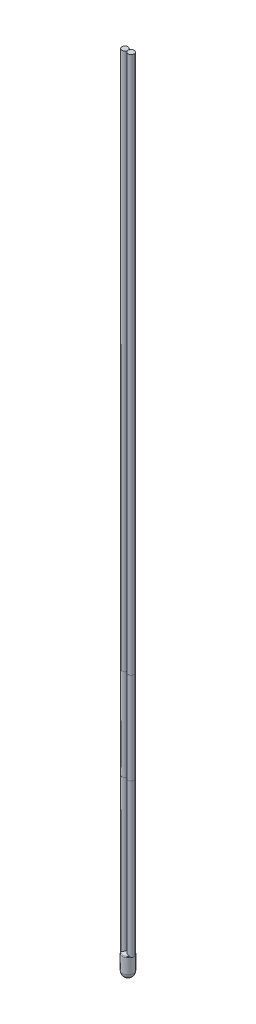
ISO-10303-21;
HEADER;
FILE_DESCRIPTION(('STEP AP214'),'2;1');
FILE_NAME('part.step','',(''),(''),'','','');
FILE_SCHEMA(('AUTOMOTIVE_DESIGN { 1 0 10303 214 1 1 1 1 }'));
ENDSEC;
DATA;
#1=APPLICATION_CONTEXT('core data for automotive mechanical design processes');
#2=APPLICATION_PROTOCOL_DEFINITION('international standard','automotive_design',2000,#1);
#3=PRODUCT_CONTEXT('',#1,'mechanical');
#4=PRODUCT('Part','Part','',(#3));
#5=PRODUCT_RELATED_PRODUCT_CATEGORY('part','',(#4));
#6=PRODUCT_DEFINITION_FORMATION('','',#4);
#7=PRODUCT_DEFINITION_CONTEXT('part definition',#1,'design');
#8=PRODUCT_DEFINITION('design','',#6,#7);
#9=PRODUCT_DEFINITION_SHAPE('','',#8);
#10=(LENGTH_UNIT() NAMED_UNIT(*) SI_UNIT(.MILLI.,.METRE.));
#11=(NAMED_UNIT(*) PLANE_ANGLE_UNIT() SI_UNIT($,.RADIAN.));
#12=(NAMED_UNIT(*) SI_UNIT($,.STERADIAN.) SOLID_ANGLE_UNIT());
#13=UNCERTAINTY_MEASURE_WITH_UNIT(LENGTH_MEASURE(1.E-05),#10,'distance_accuracy_value','');
#14=(GEOMETRIC_REPRESENTATION_CONTEXT(3) GLOBAL_UNCERTAINTY_ASSIGNED_CONTEXT((#13)) GLOBAL_UNIT_ASSIGNED_CONTEXT((#10,
#11,#12)) REPRESENTATION_CONTEXT('',''));
#15=CARTESIAN_POINT('',(0.,0.,0.));
#16=DIRECTION('',(0.,0.,1.));
#17=DIRECTION('',(1.,0.,0.));
#18=AXIS2_PLACEMENT_3D('',#15,#16,#17);
#19=CARTESIAN_POINT('',(0.4,130.41515621348,0.));
#20=DIRECTION('',(0.,-1.,0.));
#21=DIRECTION('',(0.,0.,-1.));
#22=AXIS2_PLACEMENT_3D('',#19,#20,#21);
#23=CYLINDRICAL_SURFACE('',#22,0.5);
#24=CARTESIAN_POINT('',(0.4,130.41515621348,0.));
#25=DIRECTION('',(0.,-1.,0.));
#26=DIRECTION('',(0.,0.,-1.));
#27=AXIS2_PLACEMENT_3D('',#24,#25,#26);
#28=CIRCLE('',#27,0.5);
#29=CARTESIAN_POINT('',(0.4,130.41515621348,-0.5));
#30=VERTEX_POINT('',#29);
#31=EDGE_CURVE('E11',#30,#30,#28,.T.);
#32=ORIENTED_EDGE('',*,*,#31,.T.);
#33=EDGE_LOOP('',(#32));
#34=FACE_BOUND('',#33,.T.);
#35=CARTESIAN_POINT('',(0.4,42.4151562134801,0.));
#36=DIRECTION('',(0.,-1.,0.));
#37=DIRECTION('',(0.,0.,-1.));
#38=AXIS2_PLACEMENT_3D('',#35,#36,#37);
#39=CIRCLE('',#38,0.5);
#40=CARTESIAN_POINT('',(0.4,42.4151562134801,-0.5));
#41=VERTEX_POINT('',#40);
#42=EDGE_CURVE('E44',#41,#41,#39,.T.);
#43=ORIENTED_EDGE('',*,*,#42,.F.);
#44=EDGE_LOOP('',(#43));
#45=FACE_BOUND('',#44,.T.);
#46=ADVANCED_FACE('F41',(#34,#45),#23,.T.);
#47=CARTESIAN_POINT('',(0.4,130.41515621348,0.));
#48=DIRECTION('',(0.,-1.,0.));
#49=DIRECTION('',(0.,0.,-1.));
#50=AXIS2_PLACEMENT_3D('',#47,#48,#49);
#51=PLANE('',#50);
#52=ORIENTED_EDGE('',*,*,#31,.F.);
#53=EDGE_LOOP('',(#52));
#54=FACE_BOUND('',#53,.T.);
#55=ADVANCED_FACE('F56',(#54),#51,.F.);
#56=CARTESIAN_POINT('',(0.4,42.4151562134801,0.));
#57=DIRECTION('',(0.,-1.,0.));
#58=DIRECTION('',(0.,0.,-1.));
#59=AXIS2_PLACEMENT_3D('',#56,#57,#58);
#60=PLANE('',#59);
#61=ORIENTED_EDGE('',*,*,#42,.T.);
#62=EDGE_LOOP('',(#61));
#63=FACE_BOUND('',#62,.T.);
#64=ADVANCED_FACE('F53',(#63),#60,.T.);
#65=CLOSED_SHELL('',(#46,#55,#64));
#66=MANIFOLD_SOLID_BREP('B2',#65);
#67=CARTESIAN_POINT('',(1.41,130.41515621348,0.));
#68=DIRECTION('',(0.,-1.,0.));
#69=DIRECTION('',(0.,0.,-1.));
#70=AXIS2_PLACEMENT_3D('',#67,#68,#69);
#71=CYLINDRICAL_SURFACE('',#70,0.5);
#72=CARTESIAN_POINT('',(1.41,130.41515621348,0.));
#73=DIRECTION('',(0.,-1.,0.));
#74=DIRECTION('',(0.,0.,-1.));
#75=AXIS2_PLACEMENT_3D('',#72,#73,#74);
#76=CIRCLE('',#75,0.5);
#77=CARTESIAN_POINT('',(1.41,130.41515621348,-0.5));
#78=VERTEX_POINT('',#77);
#79=EDGE_CURVE('E40',#78,#78,#76,.T.);
#80=ORIENTED_EDGE('',*,*,#79,.T.);
#81=EDGE_LOOP('',(#80));
#82=FACE_BOUND('',#81,.T.);
#83=CARTESIAN_POINT('',(1.41,42.4151562134801,0.));
#84=DIRECTION('',(0.,-1.,0.));
#85=DIRECTION('',(0.,0.,-1.));
#86=AXIS2_PLACEMENT_3D('',#83,#84,#85);
#87=CIRCLE('',#86,0.5);
#88=CARTESIAN_POINT('',(1.41,42.4151562134801,-0.5));
#89=VERTEX_POINT('',#88);
#90=EDGE_CURVE('E94',#89,#89,#87,.T.);
#91=ORIENTED_EDGE('',*,*,#90,.F.);
#92=EDGE_LOOP('',(#91));
#93=FACE_BOUND('',#92,.T.);
#94=ADVANCED_FACE('F91',(#82,#93),#71,.T.);
#95=CARTESIAN_POINT('',(1.41,130.41515621348,0.));
#96=DIRECTION('',(0.,-1.,0.));
#97=DIRECTION('',(0.,0.,-1.));
#98=AXIS2_PLACEMENT_3D('',#95,#96,#97);
#99=PLANE('',#98);
#100=ORIENTED_EDGE('',*,*,#79,.F.);
#101=EDGE_LOOP('',(#100));
#102=FACE_BOUND('',#101,.T.);
#103=ADVANCED_FACE('F106',(#102),#99,.F.);
#104=CARTESIAN_POINT('',(1.41,42.4151562134801,0.));
#105=DIRECTION('',(0.,-1.,0.));
#106=DIRECTION('',(0.,0.,-1.));
#107=AXIS2_PLACEMENT_3D('',#104,#105,#106);
#108=PLANE('',#107);
#109=ORIENTED_EDGE('',*,*,#90,.T.);
#110=EDGE_LOOP('',(#109));
#111=FACE_BOUND('',#110,.T.);
#112=ADVANCED_FACE('F103',(#111),#108,.T.);
#113=CLOSED_SHELL('',(#94,#103,#112));
#114=MANIFOLD_SOLID_BREP('B6',#113);
#115=CARTESIAN_POINT('',(0.4,42.41515621348,0.));
#116=DIRECTION('',(0.,-1.,0.));
#117=DIRECTION('',(0.,0.,-1.));
#118=AXIS2_PLACEMENT_3D('',#115,#116,#117);
#119=CYLINDRICAL_SURFACE('',#118,0.5);
#120=CARTESIAN_POINT('',(0.4,42.41515621348,0.));
#121=DIRECTION('',(0.,-1.,0.));
#122=DIRECTION('',(0.,0.,-1.));
#123=AXIS2_PLACEMENT_3D('',#120,#121,#122);
#124=CIRCLE('',#123,0.5);
#125=CARTESIAN_POINT('',(0.4,42.41515621348,-0.5));
#126=VERTEX_POINT('',#125);
#127=EDGE_CURVE('E90',#126,#126,#124,.T.);
#128=ORIENTED_EDGE('',*,*,#127,.T.);
#129=EDGE_LOOP('',(#128));
#130=FACE_BOUND('',#129,.T.);
#131=CARTESIAN_POINT('',(0.4,27.4151562134801,0.));
#132=DIRECTION('',(0.,-1.,0.));
#133=DIRECTION('',(0.,0.,-1.));
#134=AXIS2_PLACEMENT_3D('',#131,#132,#133);
#135=CIRCLE('',#134,0.5);
#136=CARTESIAN_POINT('',(0.4,27.4151562134801,-0.5));
#137=VERTEX_POINT('',#136);
#138=EDGE_CURVE('E144',#137,#137,#135,.T.);
#139=ORIENTED_EDGE('',*,*,#138,.F.);
#140=EDGE_LOOP('',(#139));
#141=FACE_BOUND('',#140,.T.);
#142=ADVANCED_FACE('F141',(#130,#141),#119,.T.);
#143=CARTESIAN_POINT('',(0.4,42.41515621348,0.));
#144=DIRECTION('',(0.,-1.,0.));
#145=DIRECTION('',(0.,0.,-1.));
#146=AXIS2_PLACEMENT_3D('',#143,#144,#145);
#147=PLANE('',#146);
#148=ORIENTED_EDGE('',*,*,#127,.F.);
#149=EDGE_LOOP('',(#148));
#150=FACE_BOUND('',#149,.T.);
#151=ADVANCED_FACE('F156',(#150),#147,.F.);
#152=CARTESIAN_POINT('',(0.4,27.4151562134801,0.));
#153=DIRECTION('',(0.,-1.,0.));
#154=DIRECTION('',(0.,0.,-1.));
#155=AXIS2_PLACEMENT_3D('',#152,#153,#154);
#156=PLANE('',#155);
#157=ORIENTED_EDGE('',*,*,#138,.T.);
#158=EDGE_LOOP('',(#157));
#159=FACE_BOUND('',#158,.T.);
#160=ADVANCED_FACE('F153',(#159),#156,.T.);
#161=CLOSED_SHELL('',(#142,#151,#160));
#162=MANIFOLD_SOLID_BREP('B35',#161);
#163=CARTESIAN_POINT('',(1.41,42.41515621348,0.));
#164=DIRECTION('',(0.,-1.,0.));
#165=DIRECTION('',(0.,0.,-1.));
#166=AXIS2_PLACEMENT_3D('',#163,#164,#165);
#167=CYLINDRICAL_SURFACE('',#166,0.5);
#168=CARTESIAN_POINT('',(1.41,42.41515621348,0.));
#169=DIRECTION('',(0.,-1.,0.));
#170=DIRECTION('',(0.,0.,-1.));
#171=AXIS2_PLACEMENT_3D('',#168,#169,#170);
#172=CIRCLE('',#171,0.5);
#173=CARTESIAN_POINT('',(1.41,42.41515621348,-0.5));
#174=VERTEX_POINT('',#173);
#175=EDGE_CURVE('E140',#174,#174,#172,.T.);
#176=ORIENTED_EDGE('',*,*,#175,.T.);
#177=EDGE_LOOP('',(#176));
#178=FACE_BOUND('',#177,.T.);
#179=CARTESIAN_POINT('',(1.41,27.4151562134801,0.));
#180=DIRECTION('',(0.,-1.,0.));
#181=DIRECTION('',(0.,0.,-1.));
#182=AXIS2_PLACEMENT_3D('',#179,#180,#181);
#183=CIRCLE('',#182,0.5);
#184=CARTESIAN_POINT('',(1.41,27.4151562134801,-0.5));
#185=VERTEX_POINT('',#184);
#186=EDGE_CURVE('E195',#185,#185,#183,.T.);
#187=ORIENTED_EDGE('',*,*,#186,.F.);
#188=EDGE_LOOP('',(#187));
#189=FACE_BOUND('',#188,.T.);
#190=ADVANCED_FACE('F192',(#178,#189),#167,.T.);
#191=CARTESIAN_POINT('',(1.41,42.41515621348,0.));
#192=DIRECTION('',(0.,-1.,0.));
#193=DIRECTION('',(0.,0.,-1.));
#194=AXIS2_PLACEMENT_3D('',#191,#192,#193);
#195=PLANE('',#194);
#196=ORIENTED_EDGE('',*,*,#175,.F.);
#197=EDGE_LOOP('',(#196));
#198=FACE_BOUND('',#197,.T.);
#199=ADVANCED_FACE('F207',(#198),#195,.F.);
#200=CARTESIAN_POINT('',(1.41,27.4151562134801,0.));
#201=DIRECTION('',(0.,-1.,0.));
#202=DIRECTION('',(0.,0.,-1.));
#203=AXIS2_PLACEMENT_3D('',#200,#201,#202);
#204=PLANE('',#203);
#205=ORIENTED_EDGE('',*,*,#186,.T.);
#206=EDGE_LOOP('',(#205));
#207=FACE_BOUND('',#206,.T.);
#208=ADVANCED_FACE('F204',(#207),#204,.T.);
#209=CLOSED_SHELL('',(#190,#199,#208));
#210=MANIFOLD_SOLID_BREP('B85',#209);
#211=CARTESIAN_POINT('',(0.9,2.41515621348005,0.));
#212=DIRECTION('',(0.,-1.,0.));
#213=DIRECTION('',(0.,0.,-1.));
#214=AXIS2_PLACEMENT_3D('',#211,#212,#213);
#215=TOROIDAL_SURFACE('',#214,0.7,0.2);
#216=CARTESIAN_POINT('',(0.342710554276178,2.6096711374537,-0.496707076060587));
#217=CARTESIAN_POINT('',(0.326116842533661,2.60699686254503,-0.494806533452094));
#218=CARTESIAN_POINT('',(0.309770034542115,2.6034465481936,-0.492066096214566));
#219=CARTESIAN_POINT('',(0.277889544530881,2.59470746117517,-0.48512967125796));
#220=CARTESIAN_POINT('',(0.262353719484357,2.58952329123451,-0.480937769219657));
#221=CARTESIAN_POINT('',(0.240017999274765,2.58066687672155,-0.473777730533588));
#222=CARTESIAN_POINT('',(0.232822842991616,2.57758212381183,-0.471284008196725));
#223=CARTESIAN_POINT('',(0.219024349225774,2.57118780814072,-0.466153855243099));
#224=CARTESIAN_POINT('',(0.212408981894553,2.56789487751942,-0.463529092972427));
#225=CARTESIAN_POINT('',(0.191949179806998,2.55694717914873,-0.454911632549412));
#226=CARTESIAN_POINT('',(0.178598488792885,2.54865469906437,-0.448536577987828));
#227=CARTESIAN_POINT('',(0.153524784459558,2.53020932378214,-0.435257162414345));
#228=CARTESIAN_POINT('',(0.141799299389649,2.52005930947381,-0.428353630542701));
#229=CARTESIAN_POINT('',(0.126569418460339,2.50363697795189,-0.418649525357035));
#230=CARTESIAN_POINT('',(0.122113207881949,2.49833768250554,-0.415697637179596));
#231=CARTESIAN_POINT('',(0.113792469919316,2.48716320505702,-0.410012721510245));
#232=CARTESIAN_POINT('',(0.109928621893607,2.48128737432261,-0.407279946999101));
#233=CARTESIAN_POINT('',(0.102936878314275,2.46879544056318,-0.402209449874787));
#234=CARTESIAN_POINT('',(0.0998222709618778,2.46216866395595,-0.399879041914674));
#235=CARTESIAN_POINT('',(0.094741260965691,2.44827830657245,-0.396014595776549));
#236=CARTESIAN_POINT('',(0.0927685097705873,2.44101851011371,-0.394476159746476));
#237=CARTESIAN_POINT('',(0.0910191836531889,2.43051207891519,-0.393104583886525));
#238=CARTESIAN_POINT('',(0.0906334576828592,2.42742055037154,-0.392800747026939));
#239=CARTESIAN_POINT('',(0.0901213443102036,2.42120391854913,-0.392396925349576));
#240=CARTESIAN_POINT('',(0.0899946835782171,2.41807885415697,-0.392296725682827));
#241=CARTESIAN_POINT('',(0.0900011063698889,2.41442991486687,-0.392301775511847));
#242=CARTESIAN_POINT('',(0.0900057868956716,2.4139036851019,-0.392305472963729));
#243=CARTESIAN_POINT('',(0.090014235433944,2.413377623837,-0.392312153477811));
#244=B_SPLINE_CURVE_WITH_KNOTS('',3,(#216,#217,#218,#219,#220,#221,#222,#223,#224,#225,#226,
#227,#228,#229,#230,#231,#232,#233,#234,#235,#236,#237,#238,#239,#240,#241,#242,#243),
.UNSPECIFIED.,.F.,.F.,(4,2,2,2,2,2,2,2,2,2,2,2,2,4),(0.,0.0506923185590828,0.101243089641447,
0.125877301665452,0.149389824798402,0.20011250552543,0.25075717596154,0.27330306641228,
0.295874623529552,0.3188210426462,0.341638626278481,0.351015232615933,0.360381940946825,
0.361960632231357),.UNSPECIFIED.);
#245=CARTESIAN_POINT('',(0.20555555555555,2.56422741198005,-0.460642331993803));
#246=VERTEX_POINT('',#245);
#247=CARTESIAN_POINT('',(0.0899999999999998,2.41515621348005,-0.39230090491866));
#248=VERTEX_POINT('',#247);
#249=EDGE_CURVE('E190',#246,#248,#244,.T.);
#250=ORIENTED_EDGE('',*,*,#249,.F.);
#251=CARTESIAN_POINT('',(0.9,2.56422741198004,0.));
#252=DIRECTION('',(0.,-1.,0.));
#253=DIRECTION('',(0.,0.,-1.));
#254=AXIS2_PLACEMENT_3D('',#251,#252,#253);
#255=CIRCLE('',#254,0.833333333333334);
#256=CARTESIAN_POINT('',(1.59072984749455,2.56422741198004,-0.466193867639426));
#257=VERTEX_POINT('',#256);
#258=EDGE_CURVE('E306',#257,#246,#255,.F.);
#259=ORIENTED_EDGE('',*,*,#258,.F.);
#260=CARTESIAN_POINT('',(1.70365777107542,2.40610173241104,-0.404679025262014));
#261=CARTESIAN_POINT('',(1.70389604383328,2.40904204718788,-0.404505427623607));
#262=CARTESIAN_POINT('',(1.70401566567529,2.41199833082941,-0.404418765222738));
#263=CARTESIAN_POINT('',(1.70402668102433,2.42065067536452,-0.404411663469807));
#264=CARTESIAN_POINT('',(1.70360453014876,2.42635106369644,-0.404719190328309));
#265=CARTESIAN_POINT('',(1.70193926885174,2.43757238417548,-0.40592158000119));
#266=CARTESIAN_POINT('',(1.70069414529646,2.44309284134493,-0.406817883031015));
#267=CARTESIAN_POINT('',(1.69705529388377,2.45534086403292,-0.409396462160241));
#268=CARTESIAN_POINT('',(1.69443632157332,2.46196830108167,-0.411229328202113));
#269=CARTESIAN_POINT('',(1.6883251125363,2.47463803783951,-0.415390033418));
#270=CARTESIAN_POINT('',(1.68483062700322,2.48067877425613,-0.41771914488632));
#271=CARTESIAN_POINT('',(1.67457897002656,2.49613661768594,-0.424329704327437));
#272=CARTESIAN_POINT('',(1.667222470359,2.50504524868047,-0.428858950109334));
#273=CARTESIAN_POINT('',(1.65127117178204,2.52156502452982,-0.438034406679147));
#274=CARTESIAN_POINT('',(1.64267468715311,2.52917437179056,-0.44268076947054));
#275=CARTESIAN_POINT('',(1.6201387405292,2.54676032002925,-0.453945963240291));
#276=CARTESIAN_POINT('',(1.60562904284585,2.55609680442867,-0.46042934676598));
#277=CARTESIAN_POINT('',(1.57632755446303,2.57208750828596,-0.471766359791853));
#278=CARTESIAN_POINT('',(1.56165246645707,2.57889713278662,-0.476709163323295));
#279=CARTESIAN_POINT('',(1.53128617958988,2.59087557342621,-0.485322279187297));
#280=CARTESIAN_POINT('',(1.51559544942571,2.59604514000795,-0.488993173579545));
#281=CARTESIAN_POINT('',(1.49493789755737,2.6015840638918,-0.492755412583465));
#282=CARTESIAN_POINT('',(1.49029630685466,2.60274909314161,-0.493533560329727));
#283=CARTESIAN_POINT('',(1.48562913972113,2.60384128817484,-0.494247137801567));
#284=B_SPLINE_CURVE_WITH_KNOTS('',3,(#260,#261,#262,#263,#264,#265,#266,#267,#268,#269,#270,
#271,#272,#273,#274,#275,#276,#277,#278,#279,#280,#281,#282,#283),.UNSPECIFIED.,.F.,.F.,(4,2,2,
2,2,2,2,2,2,2,2,4),(0.,0.00886575648618146,0.0259339496332779,0.0430440498313493,
0.0649928462677814,0.0869986080411961,0.124018945287599,0.161090093301615,0.216128364020064,
0.266736732211443,0.317321909974178,0.331862894329271),.UNSPECIFIED.);
#285=CARTESIAN_POINT('',(1.70401960784314,2.41515621348005,-0.404416209125905));
#286=VERTEX_POINT('',#285);
#287=EDGE_CURVE('E303',#286,#257,#284,.T.);
#288=ORIENTED_EDGE('',*,*,#287,.F.);
#289=CARTESIAN_POINT('',(0.9,2.41515621348005,0.));
#290=DIRECTION('',(0.,-1.,0.));
#291=DIRECTION('',(0.,0.,-1.));
#292=AXIS2_PLACEMENT_3D('',#289,#290,#291);
#293=CIRCLE('',#292,0.9);
#294=EDGE_CURVE('E283',#248,#286,#293,.T.);
#295=ORIENTED_EDGE('',*,*,#294,.F.);
#296=EDGE_LOOP('',(#250,#259,#288,#295));
#297=FACE_BOUND('',#296,.T.);
#298=ADVANCED_FACE('F234',(#297),#215,.T.);
#299=CARTESIAN_POINT('',(0.9,0.,0.));
#300=DIRECTION('',(0.,1.,0.));
#301=DIRECTION('',(-1.,0.,0.));
#302=AXIS2_PLACEMENT_3D('',#299,#300,#301);
#303=SPHERICAL_SURFACE('',#302,0.9);
#304=CARTESIAN_POINT('',(0.9,0.,0.));
#305=DIRECTION('',(0.,1.,0.));
#306=DIRECTION('',(-1.,0.,0.));
#307=AXIS2_PLACEMENT_3D('',#304,#305,#306);
#308=CIRCLE('',#307,0.9);
#309=CARTESIAN_POINT('',(0.,0.,0.));
#310=VERTEX_POINT('',#309);
#311=EDGE_CURVE('E335',#310,#310,#308,.T.);
#312=ORIENTED_EDGE('',*,*,#311,.F.);
#313=EDGE_LOOP('',(#312));
#314=FACE_BOUND('',#313,.T.);
#315=ADVANCED_FACE('F341',(#314),#303,.T.);
#316=CARTESIAN_POINT('',(0.9,1.63253242135513,0.));
#317=DIRECTION('',(0.,1.,0.));
#318=DIRECTION('',(1.,0.,0.));
#319=AXIS2_PLACEMENT_3D('',#316,#317,#318);
#320=SPHERICAL_SURFACE('',#319,1.25);
#321=CARTESIAN_POINT('',(0.205182917559304,2.56402741198004,0.460484857937039));
#322=CARTESIAN_POINT('',(0.233971584158858,2.57949526742104,0.472674656549754));
#323=CARTESIAN_POINT('',(0.263834888614331,2.59512545143631,0.482115388207938));
#324=CARTESIAN_POINT('',(0.324882062922831,2.62632224782333,0.495309528813332));
#325=CARTESIAN_POINT('',(0.356067821667557,2.64188873188452,0.499054500458566));
#326=CARTESIAN_POINT('',(0.418868509860483,2.6725351977644,0.500631357110796));
#327=CARTESIAN_POINT('',(0.450483793776784,2.68761473810425,0.498458020702542));
#328=CARTESIAN_POINT('',(0.513114021740049,2.71688826275654,0.488069098474938));
#329=CARTESIAN_POINT('',(0.544129378775547,2.73108287238938,0.479857832973678));
#330=CARTESIAN_POINT('',(0.603432306628539,2.75774534996512,0.457799964373355));
#331=CARTESIAN_POINT('',(0.63177740277301,2.77025632705399,0.444161179464198));
#332=CARTESIAN_POINT('',(0.685848125636114,2.79377590530834,0.411446097920221));
#333=CARTESIAN_POINT('',(0.711574532985435,2.80478495453323,0.392371428202314));
#334=CARTESIAN_POINT('',(0.757386234603006,2.82415850848364,0.350930619761693));
#335=CARTESIAN_POINT('',(0.777757354729829,2.83266364843309,0.328946524829438));
#336=CARTESIAN_POINT('',(0.814462558606548,2.84785970765273,0.281289176263675));
#337=CARTESIAN_POINT('',(0.830799225234937,2.85455178792111,0.255618299665267));
#338=CARTESIAN_POINT('',(0.857489245941004,2.8654218425138,0.203674733719494));
#339=CARTESIAN_POINT('',(0.868231347853134,2.8697643923131,0.177635896499791));
#340=CARTESIAN_POINT('',(0.885222369941649,2.87661208723217,0.123903501967717));
#341=CARTESIAN_POINT('',(0.891473128337311,2.8791179840666,0.0962106266531178));
#342=CARTESIAN_POINT('',(0.898965910680979,2.88211954734321,0.041750685962971));
#343=CARTESIAN_POINT('',(0.900485702044778,2.88272670445036,0.0150276235124846));
#344=CARTESIAN_POINT('',(0.899243453810239,2.88222979873035,-0.0383002481093894));
#345=CARTESIAN_POINT('',(0.896482151276341,2.88112603046862,-0.0649050768459279));
#346=CARTESIAN_POINT('',(0.886891665044591,2.87727947030919,-0.116688452941977));
#347=CARTESIAN_POINT('',(0.880145165673852,2.87456998989427,-0.141884903175672));
#348=CARTESIAN_POINT('',(0.862915071091583,2.86761424336565,-0.190737089252798));
#349=CARTESIAN_POINT('',(0.852431290747823,2.86336790112086,-0.214392748702007));
#350=CARTESIAN_POINT('',(0.827847365191678,2.85334074109884,-0.260064618192789));
#351=CARTESIAN_POINT('',(0.813674408302836,2.84752893513014,-0.28203472413694));
#352=CARTESIAN_POINT('',(0.782325180159593,2.83455869971222,-0.323262438719852));
#353=CARTESIAN_POINT('',(0.76514827462216,2.82739998583946,-0.342519472940525));
#354=CARTESIAN_POINT('',(0.727311137323574,2.81146328909359,-0.37893874801752));
#355=CARTESIAN_POINT('',(0.706510338279955,2.80261740798576,-0.395925003168429));
#356=CARTESIAN_POINT('',(0.662825996518049,2.78379890967995,-0.426179697109884));
#357=CARTESIAN_POINT('',(0.639941911935652,2.77382599917705,-0.439447164959857));
#358=CARTESIAN_POINT('',(0.590919832600233,2.7521510713304,-0.462972988952616));
#359=CARTESIAN_POINT('',(0.564666839933957,2.7403751389565,-0.47292344590208));
#360=CARTESIAN_POINT('',(0.511227452652452,2.7159880826072,-0.488264537929489));
#361=CARTESIAN_POINT('',(0.484040514212588,2.70337646791455,-0.493652467818506));
#362=CARTESIAN_POINT('',(0.427237457098062,2.67653045612116,-0.500139281132722));
#363=CARTESIAN_POINT('',(0.397601214368659,2.66224699485777,-0.500859985120792));
#364=CARTESIAN_POINT('',(0.338870422099756,2.63332105552434,-0.497120048615694));
#365=CARTESIAN_POINT('',(0.309775477916851,2.61867885861429,-0.492663346304868));
#366=CARTESIAN_POINT('',(0.255320650322216,2.59065781757185,-0.479358510250095));
#367=CARTESIAN_POINT('',(0.229856889277791,2.57728070845502,-0.470929440354684));
#368=CARTESIAN_POINT('',(0.205182917559304,2.56402741198004,-0.460484857937039));
#369=B_SPLINE_CURVE_WITH_KNOTS('',3,(#321,#322,#323,#324,#325,#326,#327,#328,#329,#330,#331,
#332,#333,#334,#335,#336,#337,#338,#339,#340,#341,#342,#343,#344,#345,#346,#347,#348,#349,#350,
#351,#352,#353,#354,#355,#356,#357,#358,#359,#360,#361,#362,#363,#364,#365,#366,#367,#368),
.UNSPECIFIED.,.F.,.F.,(4,2,2,2,2,2,2,2,2,2,2,2,2,2,2,2,2,2,2,2,2,2,2,4),(0.,0.104519174425416,
0.20919302598907,0.313959255757587,0.418650595024414,0.519668928761857,0.6206570602141,
0.713619584423865,0.806522438342577,0.891580597992968,0.976603925137676,1.05653092171055,
1.13644415899511,1.21475488229791,1.29306948538767,1.37306552614627,1.45307847848861,
1.53753986329398,1.62202327967901,1.71297064324907,1.80397189315789,1.90226336413096,
2.0004801188466,2.09008976680499),.UNSPECIFIED.);
#370=CARTESIAN_POINT('',(0.205555555555564,2.56422741198004,0.460642331993819));
#371=VERTEX_POINT('',#370);
#372=EDGE_CURVE('E345',#371,#246,#369,.T.);
#373=ORIENTED_EDGE('',*,*,#372,.F.);
#374=CARTESIAN_POINT('',(1.59072984749456,2.56422741198005,0.466193867639412));
#375=VERTEX_POINT('',#374);
#376=EDGE_CURVE('E298',#371,#375,#255,.F.);
#377=ORIENTED_EDGE('',*,*,#376,.T.);
#378=CARTESIAN_POINT('',(1.59109517886343,2.56402741198004,-0.466052074550069));
#379=CARTESIAN_POINT('',(1.56189929971724,2.58002767649732,-0.477407235839446));
#380=CARTESIAN_POINT('',(1.5316818590507,2.5961449455477,-0.485980166226311));
#381=CARTESIAN_POINT('',(1.47003320094678,2.62823131959863,-0.497371058581141));
#382=CARTESIAN_POINT('',(1.43859984411662,2.64420009583865,-0.500178358563004));
#383=CARTESIAN_POINT('',(1.37542839785553,2.67556238685268,-0.499803811214582));
#384=CARTESIAN_POINT('',(1.34369001114371,2.69095524923342,-0.496615369641568));
#385=CARTESIAN_POINT('',(1.28097777461012,2.72075295437588,-0.48412176576904));
#386=CARTESIAN_POINT('',(1.2500032981187,2.7351586254868,-0.474821802782654));
#387=CARTESIAN_POINT('',(1.19119294317666,2.76202627839447,-0.450656230430503));
#388=CARTESIAN_POINT('',(1.16327971356393,2.77454471742959,-0.43604282063928));
#389=CARTESIAN_POINT('',(1.11024446611085,2.79798858132722,-0.401432061815022));
#390=CARTESIAN_POINT('',(1.0851215269075,2.80891453240887,-0.381436497498158));
#391=CARTESIAN_POINT('',(1.0407752687385,2.82797897301611,-0.338444173481457));
#392=CARTESIAN_POINT('',(1.02123170291811,2.83627562384071,-0.31584813612629));
#393=CARTESIAN_POINT('',(0.986276705625963,2.85099541362998,-0.267124775723333));
#394=CARTESIAN_POINT('',(0.970862515398599,2.85741980366905,-0.240999827911772));
#395=CARTESIAN_POINT('',(0.946031278855372,2.86771350626024,-0.188425340736445));
#396=CARTESIAN_POINT('',(0.936210315890858,2.87175597935573,-0.162200075210661));
#397=CARTESIAN_POINT('',(0.921062025827062,2.87797472146548,-0.108272579146993));
#398=CARTESIAN_POINT('',(0.915732890355399,2.88015174150149,-0.0805709477619912));
#399=CARTESIAN_POINT('',(0.909985745536684,2.8824987342198,-0.026233701363912));
#400=CARTESIAN_POINT('',(0.909297636932613,2.8827790922807,0.000368946361625292));
#401=CARTESIAN_POINT('',(0.912143936315899,2.88161749969605,0.0533066389657466));
#402=CARTESIAN_POINT('',(0.915677693397838,2.88017581454623,0.0796417244644516));
#403=CARTESIAN_POINT('',(0.926726744789865,2.87565094977677,0.130850792933531));
#404=CARTESIAN_POINT('',(0.934175093104653,2.87259536624814,0.155741755923523));
#405=CARTESIAN_POINT('',(0.952722090923995,2.86494389413218,0.203867942016433));
#406=CARTESIAN_POINT('',(0.963820990405837,2.86034790006239,0.227103051599558));
#407=CARTESIAN_POINT('',(0.989597939229971,2.84959432158708,0.271933709776604));
#408=CARTESIAN_POINT('',(1.00436148335052,2.84339926927445,0.293470980003378));
#409=CARTESIAN_POINT('',(1.0367915879172,2.82966219620989,0.333743067860019));
#410=CARTESIAN_POINT('',(1.05445882941956,2.82211985941902,0.352477226051678));
#411=CARTESIAN_POINT('',(1.09327705208838,2.80536302982811,0.387835742875559));
#412=CARTESIAN_POINT('',(1.11457375722783,2.79607519027448,0.404265102837223));
#413=CARTESIAN_POINT('',(1.15913640261654,2.77637589549268,0.433331107082242));
#414=CARTESIAN_POINT('',(1.18240282445218,2.76596416530646,0.445966820383854));
#415=CARTESIAN_POINT('',(1.23219161707357,2.74334399642579,0.46817252389763));
#416=CARTESIAN_POINT('',(1.25882534023157,2.73105839843051,0.477414056831497));
#417=CARTESIAN_POINT('',(1.3129000686153,2.70566023022712,0.491275639916515));
#418=CARTESIAN_POINT('',(1.34034165891586,2.69254705239527,0.495892251401175));
#419=CARTESIAN_POINT('',(1.39761543819291,2.66463842718479,0.500739180828493));
#420=CARTESIAN_POINT('',(1.42745706499141,2.64979367367308,0.500573783170588));
#421=CARTESIAN_POINT('',(1.48643521179335,2.61978102430603,0.495008580568989));
#422=CARTESIAN_POINT('',(1.51557260551271,2.60461357795685,0.489615643314676));
#423=CARTESIAN_POINT('',(1.55994387438109,2.58096875538201,0.477275167916566));
#424=CARTESIAN_POINT('',(1.57566459684504,2.57247832366036,0.47205019083586));
#425=CARTESIAN_POINT('',(1.59109517886369,2.56402741198005,0.466052074550976));
#426=B_SPLINE_CURVE_WITH_KNOTS('',3,(#378,#379,#380,#381,#382,#383,#384,#385,#386,#387,#388,
#389,#390,#391,#392,#393,#394,#395,#396,#397,#398,#399,#400,#401,#402,#403,#404,#405,#406,#407,
#408,#409,#410,#411,#412,#413,#414,#415,#416,#417,#418,#419,#420,#421,#422,#423,#424,#425),
.UNSPECIFIED.,.F.,.F.,(4,2,2,2,2,2,2,2,2,2,2,2,2,2,2,2,2,2,2,2,2,2,2,4),(0.,0.105413590810882,
0.211021940887962,0.316746509188022,0.422381249651535,0.523545438942917,0.624676123545768,
0.717192495524503,0.809646904095704,0.894090213258967,0.97849950998854,1.057950460998,
1.13738916425129,1.21551153567365,1.29363925776357,1.37379673241425,1.45397303473647,
1.53897770241468,1.62400321368638,1.71586967701633,1.80780439322422,1.90736700377021,
2.00679899078983,2.06256833756391),.UNSPECIFIED.);
#427=EDGE_CURVE('E329',#257,#375,#426,.T.);
#428=ORIENTED_EDGE('',*,*,#427,.F.);
#429=ORIENTED_EDGE('',*,*,#258,.T.);
#430=EDGE_LOOP('',(#373,#377,#428,#429));
#431=FACE_BOUND('',#430,.T.);
#432=ADVANCED_FACE('F338',(#431),#320,.T.);
#433=CARTESIAN_POINT('',(0.9,2.88253242135513,0.));
#434=DIRECTION('',(0.,1.,0.));
#435=DIRECTION('',(-1.,0.,0.));
#436=AXIS2_PLACEMENT_3D('',#433,#434,#435);
#437=CYLINDRICAL_SURFACE('',#436,0.9);
#438=CARTESIAN_POINT('',(1.70401960784314,2.41515621348005,0.404416209125905));
#439=VERTEX_POINT('',#438);
#440=EDGE_CURVE('E302',#286,#439,#293,.T.);
#441=ORIENTED_EDGE('',*,*,#440,.T.);
#442=CARTESIAN_POINT('',(0.0899999999999999,2.41515621348005,0.392300904918661));
#443=VERTEX_POINT('',#442);
#444=EDGE_CURVE('E282',#439,#443,#293,.T.);
#445=ORIENTED_EDGE('',*,*,#444,.T.);
#446=EDGE_CURVE('E278',#443,#248,#293,.T.);
#447=ORIENTED_EDGE('',*,*,#446,.T.);
#448=ORIENTED_EDGE('',*,*,#294,.T.);
#449=EDGE_LOOP('',(#441,#445,#447,#448));
#450=FACE_BOUND('',#449,.T.);
#451=ORIENTED_EDGE('',*,*,#311,.T.);
#452=EDGE_LOOP('',(#451));
#453=FACE_BOUND('',#452,.T.);
#454=ADVANCED_FACE('F300',(#450,#453),#437,.T.);
#455=CARTESIAN_POINT('',(0.0900142354339442,2.413377623837,0.392312153477811));
#456=CARTESIAN_POINT('',(0.0900057541266962,2.41390364139671,0.392305440442877));
#457=CARTESIAN_POINT('',(0.0900010761450986,2.41442987026323,0.392301745679841));
#458=CARTESIAN_POINT('',(0.0899908939182519,2.42041031500487,0.392293808879575));
#459=CARTESIAN_POINT('',(0.0903876873945785,2.42587669504093,0.392608295677278));
#460=CARTESIAN_POINT('',(0.0919483170694864,2.43663689482024,0.393833813627084));
#461=CARTESIAN_POINT('',(0.0931148108885355,2.44193004974982,0.394746911592397));
#462=CARTESIAN_POINT('',(0.0965276680783706,2.45369226976503,0.397379300853799));
#463=CARTESIAN_POINT('',(0.0989878088160566,2.4600631115645,0.399254715860878));
#464=CARTESIAN_POINT('',(0.104721951369748,2.47223817724391,0.40351421133557));
#465=CARTESIAN_POINT('',(0.107997751237576,2.47804110931123,0.405899413919345));
#466=CARTESIAN_POINT('',(0.117726504458136,2.49309236848218,0.41276817561379));
#467=CARTESIAN_POINT('',(0.124772504708991,2.50182487308936,0.417529250579425));
#468=CARTESIAN_POINT('',(0.140059269926464,2.51803623911069,0.427216257759249));
#469=CARTESIAN_POINT('',(0.148302063542647,2.52551292445657,0.432142458744883));
#470=CARTESIAN_POINT('',(0.164542651928677,2.53851689638451,0.441173893519793));
#471=CARTESIAN_POINT('',(0.172427450644795,2.54417120238612,0.445301233098171));
#472=CARTESIAN_POINT('',(0.188767779307274,2.55479637884453,0.453281191485976));
#473=CARTESIAN_POINT('',(0.197223224947138,2.55976734992808,0.457133850704057));
#474=CARTESIAN_POINT('',(0.223478603776209,2.57382184269263,0.468189803567446));
#475=CARTESIAN_POINT('',(0.242044779602056,2.5819527279381,0.47482065562956));
#476=CARTESIAN_POINT('',(0.280663118502849,2.59574200515939,0.485965007769324));
#477=CARTESIAN_POINT('',(0.300713961297395,2.6014025637741,0.490480363533088));
#478=CARTESIAN_POINT('',(0.328336954348181,2.60718920951665,0.494891121079039));
#479=CARTESIAN_POINT('',(0.335501946546303,2.60851479514757,0.49587741575288));
#480=CARTESIAN_POINT('',(0.342710554276178,2.6096711374537,0.496707076060589));
#481=B_SPLINE_CURVE_WITH_KNOTS('',3,(#455,#456,#457,#458,#459,#460,#461,#462,#463,#464,#465,
#466,#467,#468,#469,#470,#471,#472,#473,#474,#475,#476,#477,#478,#479,#480),.UNSPECIFIED.,.F.,
.F.,(4,2,2,2,2,2,2,2,2,2,2,2,4),(0.,0.0015786912829187,0.0179374896072321,0.0343530692281405,
0.0554774301409264,0.0766487767120373,0.113012766125561,0.149439130714118,0.181025015527393,
0.212606244062943,0.276272276829786,0.339882357524839,0.361927766043739),.UNSPECIFIED.);
#482=EDGE_CURVE('E247',#443,#371,#481,.T.);
#483=ORIENTED_EDGE('',*,*,#482,.F.);
#484=ORIENTED_EDGE('',*,*,#444,.F.);
#485=CARTESIAN_POINT('',(1.59036397368029,2.56442741198001,0.466335541212821));
#486=CARTESIAN_POINT('',(1.5973360796673,2.56061873238883,0.463638603004759));
#487=CARTESIAN_POINT('',(1.60414324858272,2.5566067512118,0.460825637191355));
#488=CARTESIAN_POINT('',(1.61741257768417,2.54811962537918,0.455008912208966));
#489=CARTESIAN_POINT('',(1.62387350782681,2.54364297652896,0.452004546388216));
#490=CARTESIAN_POINT('',(1.6428145479229,2.52934307579804,0.442712237661609));
#491=CARTESIAN_POINT('',(1.65466155882263,2.51875065531443,0.436220958893895));
#492=CARTESIAN_POINT('',(1.66984634078226,2.50164628895631,0.427211907447637));
#493=CARTESIAN_POINT('',(1.67423847461032,2.4961638393826,0.424501579458626));
#494=CARTESIAN_POINT('',(1.68236683833714,2.4846313911739,0.419331780696356));
#495=CARTESIAN_POINT('',(1.68610460118604,2.47858277134815,0.416871729442884));
#496=CARTESIAN_POINT('',(1.69224707788071,2.46678204273043,0.412732811012051));
#497=CARTESIAN_POINT('',(1.69476616265774,2.46111220199629,0.41099248828768));
#498=CARTESIAN_POINT('',(1.69898751193248,2.4493557903195,0.408035423593887));
#499=CARTESIAN_POINT('',(1.70069279434929,2.44327085624681,0.406816748896858));
#500=CARTESIAN_POINT('',(1.70260094593574,2.43343733893364,0.405444763930635));
#501=CARTESIAN_POINT('',(1.70313408524625,2.42978365701233,0.405058934285818));
#502=CARTESIAN_POINT('',(1.70384867679137,2.42240680459159,0.404540494899205));
#503=CARTESIAN_POINT('',(1.70402841419422,2.41868338334019,0.404409119907637));
#504=CARTESIAN_POINT('',(1.70401943137251,2.41495621348005,0.404416337423927));
#505=B_SPLINE_CURVE_WITH_KNOTS('',3,(#485,#486,#487,#488,#489,#490,#491,#492,#493,#494,#495,
#496,#497,#498,#499,#500,#501,#502,#503,#504),.UNSPECIFIED.,.F.,.F.,(4,2,2,2,2,2,2,2,2,4),(0.,
0.0251482983136293,0.0503807063279775,0.101527724062385,0.124079925354553,0.146578566848934,
0.165844550411176,0.185038521513384,0.196151794836939,0.207318861922355),.UNSPECIFIED.);
#506=EDGE_CURVE('E299',#375,#439,#505,.T.);
#507=ORIENTED_EDGE('',*,*,#506,.F.);
#508=ORIENTED_EDGE('',*,*,#376,.F.);
#509=EDGE_LOOP('',(#483,#484,#507,#508));
#510=FACE_BOUND('',#509,.T.);
#511=ADVANCED_FACE('F236',(#510),#215,.T.);
#512=CARTESIAN_POINT('',(1.41,27.4151562134801,0.));
#513=DIRECTION('',(0.,-1.,0.));
#514=DIRECTION('',(0.,0.,-1.));
#515=AXIS2_PLACEMENT_3D('',#512,#513,#514);
#516=CYLINDRICAL_SURFACE('',#515,0.5);
#517=CARTESIAN_POINT('',(1.41,27.4151562134801,0.));
#518=DIRECTION('',(0.,-1.,0.));
#519=DIRECTION('',(0.,0.,-1.));
#520=AXIS2_PLACEMENT_3D('',#517,#518,#519);
#521=CIRCLE('',#520,0.5);
#522=CARTESIAN_POINT('',(1.41,27.4151562134801,-0.5));
#523=VERTEX_POINT('',#522);
#524=EDGE_CURVE('E336',#523,#523,#521,.T.);
#525=ORIENTED_EDGE('',*,*,#524,.T.);
#526=EDGE_LOOP('',(#525));
#527=FACE_BOUND('',#526,.T.);
#528=ORIENTED_EDGE('',*,*,#427,.T.);
#529=ORIENTED_EDGE('',*,*,#506,.T.);
#530=CARTESIAN_POINT('',(1.41,2.41515621348005,0.));
#531=DIRECTION('',(0.,-1.,0.));
#532=DIRECTION('',(0.,0.,-1.));
#533=AXIS2_PLACEMENT_3D('',#530,#531,#532);
#534=CIRCLE('',#533,0.5);
#535=EDGE_CURVE('E259',#286,#439,#534,.T.);
#536=ORIENTED_EDGE('',*,*,#535,.F.);
#537=ORIENTED_EDGE('',*,*,#287,.T.);
#538=EDGE_LOOP('',(#528,#529,#536,#537));
#539=FACE_BOUND('',#538,.T.);
#540=ADVANCED_FACE('F316',(#527,#539),#516,.T.);
#541=CARTESIAN_POINT('',(1.41,27.4151562134801,0.));
#542=DIRECTION('',(0.,-1.,0.));
#543=DIRECTION('',(0.,0.,-1.));
#544=AXIS2_PLACEMENT_3D('',#541,#542,#543);
#545=PLANE('',#544);
#546=ORIENTED_EDGE('',*,*,#524,.F.);
#547=EDGE_LOOP('',(#546));
#548=FACE_BOUND('',#547,.T.);
#549=ADVANCED_FACE('F321',(#548),#545,.F.);
#550=CARTESIAN_POINT('',(1.41,2.41515621348005,0.));
#551=DIRECTION('',(0.,-1.,0.));
#552=DIRECTION('',(0.,0.,-1.));
#553=AXIS2_PLACEMENT_3D('',#550,#551,#552);
#554=PLANE('',#553);
#555=ORIENTED_EDGE('',*,*,#535,.T.);
#556=ORIENTED_EDGE('',*,*,#440,.F.);
#557=EDGE_LOOP('',(#555,#556));
#558=FACE_BOUND('',#557,.T.);
#559=ADVANCED_FACE('F323',(#558),#554,.T.);
#560=CARTESIAN_POINT('',(0.4,27.4151562134801,0.));
#561=DIRECTION('',(0.,-1.,0.));
#562=DIRECTION('',(0.,0.,-1.));
#563=AXIS2_PLACEMENT_3D('',#560,#561,#562);
#564=CYLINDRICAL_SURFACE('',#563,0.5);
#565=CARTESIAN_POINT('',(0.4,27.4151562134801,0.));
#566=DIRECTION('',(0.,-1.,0.));
#567=DIRECTION('',(0.,0.,-1.));
#568=AXIS2_PLACEMENT_3D('',#565,#566,#567);
#569=CIRCLE('',#568,0.5);
#570=CARTESIAN_POINT('',(0.4,27.4151562134801,-0.5));
#571=VERTEX_POINT('',#570);
#572=EDGE_CURVE('E291',#571,#571,#569,.T.);
#573=ORIENTED_EDGE('',*,*,#572,.T.);
#574=EDGE_LOOP('',(#573));
#575=FACE_BOUND('',#574,.T.);
#576=ORIENTED_EDGE('',*,*,#372,.T.);
#577=ORIENTED_EDGE('',*,*,#249,.T.);
#578=CARTESIAN_POINT('',(0.4,2.41515621348005,0.));
#579=DIRECTION('',(0.,-1.,0.));
#580=DIRECTION('',(0.,0.,-1.));
#581=AXIS2_PLACEMENT_3D('',#578,#579,#580);
#582=CIRCLE('',#581,0.5);
#583=EDGE_CURVE('E253',#443,#248,#582,.T.);
#584=ORIENTED_EDGE('',*,*,#583,.F.);
#585=ORIENTED_EDGE('',*,*,#482,.T.);
#586=EDGE_LOOP('',(#576,#577,#584,#585));
#587=FACE_BOUND('',#586,.T.);
#588=ADVANCED_FACE('F287',(#575,#587),#564,.T.);
#589=CARTESIAN_POINT('',(0.4,27.4151562134801,0.));
#590=DIRECTION('',(0.,-1.,0.));
#591=DIRECTION('',(0.,0.,-1.));
#592=AXIS2_PLACEMENT_3D('',#589,#590,#591);
#593=PLANE('',#592);
#594=ORIENTED_EDGE('',*,*,#572,.F.);
#595=EDGE_LOOP('',(#594));
#596=FACE_BOUND('',#595,.T.);
#597=ADVANCED_FACE('F353',(#596),#593,.F.);
#598=CARTESIAN_POINT('',(0.4,2.41515621348005,0.));
#599=DIRECTION('',(0.,-1.,0.));
#600=DIRECTION('',(0.,0.,-1.));
#601=AXIS2_PLACEMENT_3D('',#598,#599,#600);
#602=PLANE('',#601);
#603=ORIENTED_EDGE('',*,*,#583,.T.);
#604=ORIENTED_EDGE('',*,*,#446,.F.);
#605=EDGE_LOOP('',(#603,#604));
#606=FACE_BOUND('',#605,.T.);
#607=ADVANCED_FACE('F279',(#606),#602,.T.);
#608=CLOSED_SHELL('',(#298,#315,#432,#454,#511,#540,#549,#559,#588,#597,#607));
#609=MANIFOLD_SOLID_BREP('B135',#608);
#610=ADVANCED_BREP_SHAPE_REPRESENTATION('',(#18,#66,#114,#162,#210,#609),#14);
#611=SHAPE_DEFINITION_REPRESENTATION(#9,#610);
ENDSEC;
END-ISO-10303-21;
